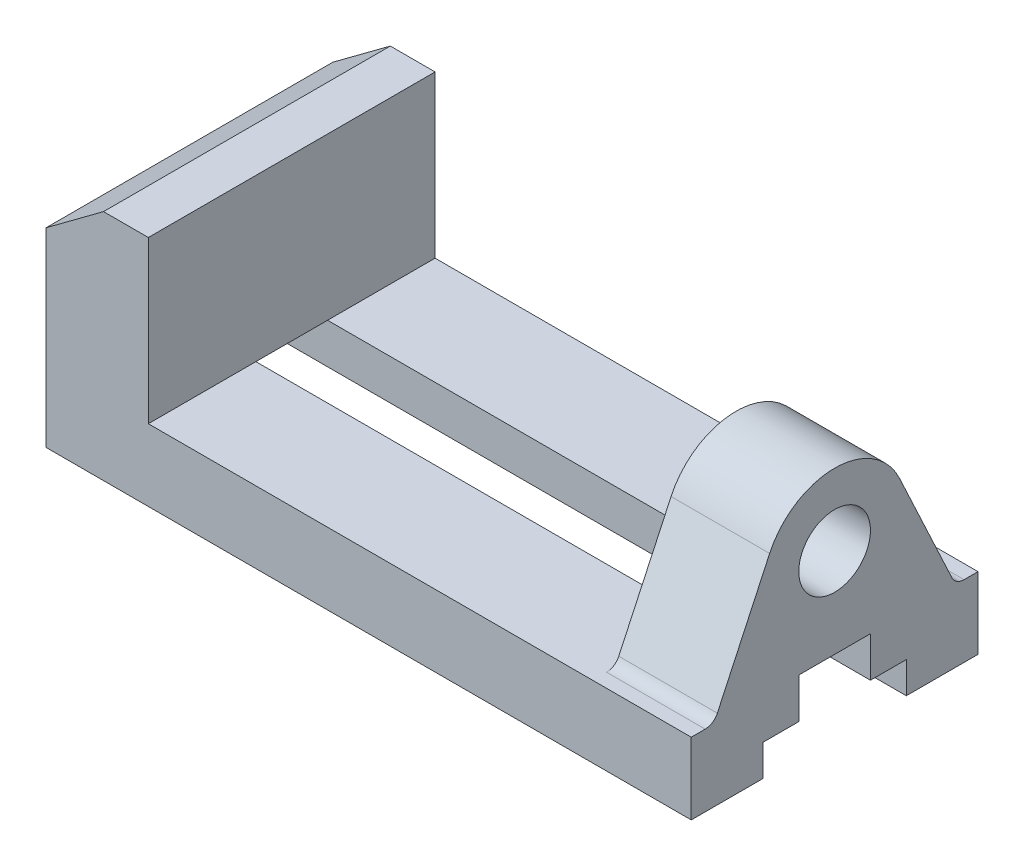
ISO-10303-21;
HEADER;
FILE_DESCRIPTION(('STEP AP214'),'2;1');
FILE_NAME('part.step','',(''),(''),'','','');
FILE_SCHEMA(('AUTOMOTIVE_DESIGN { 1 0 10303 214 1 1 1 1 }'));
ENDSEC;
DATA;
#1=APPLICATION_CONTEXT('core data for automotive mechanical design processes');
#2=APPLICATION_PROTOCOL_DEFINITION('international standard','automotive_design',2000,#1);
#3=PRODUCT_CONTEXT('',#1,'mechanical');
#4=PRODUCT('Part','Part','',(#3));
#5=PRODUCT_RELATED_PRODUCT_CATEGORY('part','',(#4));
#6=PRODUCT_DEFINITION_FORMATION('','',#4);
#7=PRODUCT_DEFINITION_CONTEXT('part definition',#1,'design');
#8=PRODUCT_DEFINITION('design','',#6,#7);
#9=PRODUCT_DEFINITION_SHAPE('','',#8);
#10=(LENGTH_UNIT() NAMED_UNIT(*) SI_UNIT(.MILLI.,.METRE.));
#11=(NAMED_UNIT(*) PLANE_ANGLE_UNIT() SI_UNIT($,.RADIAN.));
#12=(NAMED_UNIT(*) SI_UNIT($,.STERADIAN.) SOLID_ANGLE_UNIT());
#13=UNCERTAINTY_MEASURE_WITH_UNIT(LENGTH_MEASURE(1.E-05),#10,'distance_accuracy_value','');
#14=(GEOMETRIC_REPRESENTATION_CONTEXT(3) GLOBAL_UNCERTAINTY_ASSIGNED_CONTEXT((#13)) GLOBAL_UNIT_ASSIGNED_CONTEXT((#10,
#11,#12)) REPRESENTATION_CONTEXT('',''));
#15=CARTESIAN_POINT('',(0.,0.,0.));
#16=DIRECTION('',(0.,0.,1.));
#17=DIRECTION('',(1.,0.,0.));
#18=AXIS2_PLACEMENT_3D('',#15,#16,#17);
#19=CARTESIAN_POINT('',(22.8395146915876,16.,32.));
#20=DIRECTION('',(0.,-1.,0.));
#21=DIRECTION('',(0.,0.,-1.));
#22=AXIS2_PLACEMENT_3D('',#19,#20,#21);
#23=PLANE('',#22);
#24=DIRECTION('',(0.,0.,1.));
#25=VECTOR('',#24,1.);
#26=CARTESIAN_POINT('',(122.,16.,0.));
#27=LINE('',#26,#25);
#28=CARTESIAN_POINT('',(122.,16.,8.));
#29=VERTEX_POINT('',#28);
#30=CARTESIAN_POINT('',(122.,16.,28.8914106489223));
#31=VERTEX_POINT('',#30);
#32=EDGE_CURVE('E361',#29,#31,#27,.T.);
#33=ORIENTED_EDGE('',*,*,#32,.F.);
#34=DIRECTION('',(1.,0.,0.));
#35=VECTOR('',#34,1.);
#36=CARTESIAN_POINT('',(-0.001000000000001,16.,8.));
#37=LINE('',#36,#35);
#38=CARTESIAN_POINT('',(22.8395146915876,16.,8.));
#39=VERTEX_POINT('',#38);
#40=EDGE_CURVE('E67',#39,#29,#37,.T.);
#41=ORIENTED_EDGE('',*,*,#40,.F.);
#42=DIRECTION('',(0.,0.,-1.));
#43=VECTOR('',#42,1.);
#44=CARTESIAN_POINT('',(22.8395146915876,16.,32.));
#45=LINE('',#44,#43);
#46=CARTESIAN_POINT('',(22.8395146915876,16.,32.));
#47=VERTEX_POINT('',#46);
#48=EDGE_CURVE('E242',#47,#39,#45,.T.);
#49=ORIENTED_EDGE('',*,*,#48,.F.);
#50=DIRECTION('',(-1.,0.,0.));
#51=VECTOR('',#50,1.);
#52=CARTESIAN_POINT('',(22.8395146915876,16.,32.));
#53=LINE('',#52,#51);
#54=CARTESIAN_POINT('',(144.,16.,32.));
#55=VERTEX_POINT('',#54);
#56=EDGE_CURVE('E291',#55,#47,#53,.T.);
#57=ORIENTED_EDGE('',*,*,#56,.F.);
#58=DIRECTION('',(0.,0.,-1.));
#59=VECTOR('',#58,1.);
#60=CARTESIAN_POINT('',(144.,16.,32.));
#61=LINE('',#60,#59);
#62=CARTESIAN_POINT('',(144.,16.,28.8914106489223));
#63=VERTEX_POINT('',#62);
#64=EDGE_CURVE('E245',#55,#63,#61,.T.);
#65=ORIENTED_EDGE('',*,*,#64,.T.);
#66=DIRECTION('',(1.,0.,0.));
#67=VECTOR('',#66,1.);
#68=CARTESIAN_POINT('',(122.,16.,28.8914106489223));
#69=LINE('',#68,#67);
#70=EDGE_CURVE('E308',#31,#63,#69,.T.);
#71=ORIENTED_EDGE('',*,*,#70,.F.);
#72=EDGE_LOOP('',(#33,#41,#49,#57,#65,#71));
#73=FACE_BOUND('',#72,.T.);
#74=ADVANCED_FACE('F44',(#73),#23,.F.);
#75=CARTESIAN_POINT('',(144.,0.,32.));
#76=DIRECTION('',(0.,1.,0.));
#77=DIRECTION('',(0.,0.,1.));
#78=AXIS2_PLACEMENT_3D('',#75,#76,#77);
#79=PLANE('',#78);
#80=CARTESIAN_POINT('',(108.,0.,22.));
#81=DIRECTION('',(0.,-1.,0.));
#82=DIRECTION('',(0.,0.,-1.));
#83=AXIS2_PLACEMENT_3D('',#80,#81,#82);
#84=CIRCLE('',#83,3.);
#85=CARTESIAN_POINT('',(108.,0.,19.));
#86=VERTEX_POINT('',#85);
#87=EDGE_CURVE('E419',#86,#86,#84,.T.);
#88=ORIENTED_EDGE('',*,*,#87,.F.);
#89=EDGE_LOOP('',(#88));
#90=FACE_BOUND('',#89,.T.);
#91=CARTESIAN_POINT('',(38.,0.,22.));
#92=DIRECTION('',(0.,-1.,0.));
#93=DIRECTION('',(0.,0.,-1.));
#94=AXIS2_PLACEMENT_3D('',#91,#92,#93);
#95=CIRCLE('',#94,3.);
#96=CARTESIAN_POINT('',(38.,0.,19.));
#97=VERTEX_POINT('',#96);
#98=EDGE_CURVE('E416',#97,#97,#95,.T.);
#99=ORIENTED_EDGE('',*,*,#98,.F.);
#100=EDGE_LOOP('',(#99));
#101=FACE_BOUND('',#100,.T.);
#102=DIRECTION('',(0.,0.,-1.));
#103=VECTOR('',#102,1.);
#104=CARTESIAN_POINT('',(0.,0.,32.));
#105=LINE('',#104,#103);
#106=CARTESIAN_POINT('',(0.,0.,32.));
#107=VERTEX_POINT('',#106);
#108=CARTESIAN_POINT('',(0.,0.,16.));
#109=VERTEX_POINT('',#108);
#110=EDGE_CURVE('E224',#107,#109,#105,.T.);
#111=ORIENTED_EDGE('',*,*,#110,.T.);
#112=DIRECTION('',(1.,0.,0.));
#113=VECTOR('',#112,1.);
#114=CARTESIAN_POINT('',(-0.001000000000001,0.,16.));
#115=LINE('',#114,#113);
#116=CARTESIAN_POINT('',(144.,0.,16.));
#117=VERTEX_POINT('',#116);
#118=EDGE_CURVE('E209',#109,#117,#115,.T.);
#119=ORIENTED_EDGE('',*,*,#118,.T.);
#120=DIRECTION('',(0.,0.,-1.));
#121=VECTOR('',#120,1.);
#122=CARTESIAN_POINT('',(144.,0.,32.));
#123=LINE('',#122,#121);
#124=CARTESIAN_POINT('',(144.,0.,32.));
#125=VERTEX_POINT('',#124);
#126=EDGE_CURVE('E13',#125,#117,#123,.T.);
#127=ORIENTED_EDGE('',*,*,#126,.F.);
#128=DIRECTION('',(1.,0.,0.));
#129=VECTOR('',#128,1.);
#130=CARTESIAN_POINT('',(144.,0.,32.));
#131=LINE('',#130,#129);
#132=EDGE_CURVE('E284',#107,#125,#131,.T.);
#133=ORIENTED_EDGE('',*,*,#132,.F.);
#134=EDGE_LOOP('',(#111,#119,#127,#133));
#135=FACE_BOUND('',#134,.T.);
#136=ADVANCED_FACE('F388',(#90,#101,#135),#79,.F.);
#137=CARTESIAN_POINT('',(22.8395146915876,16.,-8.));
#138=VERTEX_POINT('',#137);
#139=CARTESIAN_POINT('',(22.8395146915876,16.,-32.));
#140=VERTEX_POINT('',#139);
#141=EDGE_CURVE('E241',#138,#140,#45,.T.);
#142=ORIENTED_EDGE('',*,*,#141,.F.);
#143=DIRECTION('',(1.,0.,0.));
#144=VECTOR('',#143,1.);
#145=CARTESIAN_POINT('',(-0.001000000000001,16.,-8.));
#146=LINE('',#145,#144);
#147=CARTESIAN_POINT('',(122.,16.,-8.));
#148=VERTEX_POINT('',#147);
#149=EDGE_CURVE('E474',#138,#148,#146,.T.);
#150=ORIENTED_EDGE('',*,*,#149,.T.);
#151=CARTESIAN_POINT('',(122.,16.,-28.8914106489223));
#152=VERTEX_POINT('',#151);
#153=EDGE_CURVE('E330',#152,#148,#27,.T.);
#154=ORIENTED_EDGE('',*,*,#153,.F.);
#155=DIRECTION('',(1.,0.,0.));
#156=VECTOR('',#155,1.);
#157=CARTESIAN_POINT('',(122.,16.,-28.8914106489223));
#158=LINE('',#157,#156);
#159=CARTESIAN_POINT('',(144.,16.,-28.8914106489223));
#160=VERTEX_POINT('',#159);
#161=EDGE_CURVE('E261',#152,#160,#158,.T.);
#162=ORIENTED_EDGE('',*,*,#161,.T.);
#163=CARTESIAN_POINT('',(144.,16.,-32.));
#164=VERTEX_POINT('',#163);
#165=EDGE_CURVE('E244',#160,#164,#61,.T.);
#166=ORIENTED_EDGE('',*,*,#165,.T.);
#167=DIRECTION('',(-1.,0.,0.));
#168=VECTOR('',#167,1.);
#169=CARTESIAN_POINT('',(22.8395146915876,16.,-32.));
#170=LINE('',#169,#168);
#171=EDGE_CURVE('E258',#164,#140,#170,.T.);
#172=ORIENTED_EDGE('',*,*,#171,.T.);
#173=EDGE_LOOP('',(#142,#150,#154,#162,#166,#172));
#174=FACE_BOUND('',#173,.T.);
#175=ADVANCED_FACE('F256',(#174),#23,.F.);
#176=CARTESIAN_POINT('',(108.,0.,-22.));
#177=DIRECTION('',(0.,-1.,0.));
#178=DIRECTION('',(0.,0.,-1.));
#179=AXIS2_PLACEMENT_3D('',#176,#177,#178);
#180=CIRCLE('',#179,3.);
#181=CARTESIAN_POINT('',(108.,0.,-25.));
#182=VERTEX_POINT('',#181);
#183=EDGE_CURVE('E407',#182,#182,#180,.T.);
#184=ORIENTED_EDGE('',*,*,#183,.F.);
#185=EDGE_LOOP('',(#184));
#186=FACE_BOUND('',#185,.T.);
#187=CARTESIAN_POINT('',(38.,0.,-22.));
#188=DIRECTION('',(0.,-1.,0.));
#189=DIRECTION('',(0.,0.,-1.));
#190=AXIS2_PLACEMENT_3D('',#187,#188,#189);
#191=CIRCLE('',#190,3.);
#192=CARTESIAN_POINT('',(38.,0.,-25.));
#193=VERTEX_POINT('',#192);
#194=EDGE_CURVE('E410',#193,#193,#191,.T.);
#195=ORIENTED_EDGE('',*,*,#194,.F.);
#196=EDGE_LOOP('',(#195));
#197=FACE_BOUND('',#196,.T.);
#198=CARTESIAN_POINT('',(144.,0.,-16.));
#199=VERTEX_POINT('',#198);
#200=CARTESIAN_POINT('',(144.,0.,-32.));
#201=VERTEX_POINT('',#200);
#202=EDGE_CURVE('E52',#199,#201,#123,.T.);
#203=ORIENTED_EDGE('',*,*,#202,.F.);
#204=DIRECTION('',(1.,0.,0.));
#205=VECTOR('',#204,1.);
#206=CARTESIAN_POINT('',(-0.001000000000001,0.,-16.));
#207=LINE('',#206,#205);
#208=CARTESIAN_POINT('',(0.,0.,-16.));
#209=VERTEX_POINT('',#208);
#210=EDGE_CURVE('E203',#209,#199,#207,.T.);
#211=ORIENTED_EDGE('',*,*,#210,.F.);
#212=CARTESIAN_POINT('',(0.,0.,-32.));
#213=VERTEX_POINT('',#212);
#214=EDGE_CURVE('E214',#209,#213,#105,.T.);
#215=ORIENTED_EDGE('',*,*,#214,.T.);
#216=DIRECTION('',(1.,0.,0.));
#217=VECTOR('',#216,1.);
#218=CARTESIAN_POINT('',(144.,0.,-32.));
#219=LINE('',#218,#217);
#220=EDGE_CURVE('E270',#213,#201,#219,.T.);
#221=ORIENTED_EDGE('',*,*,#220,.T.);
#222=EDGE_LOOP('',(#203,#211,#215,#221));
#223=FACE_BOUND('',#222,.T.);
#224=ADVANCED_FACE('F46',(#186,#197,#223),#79,.F.);
#225=CARTESIAN_POINT('',(144.,16.,32.));
#226=DIRECTION('',(-1.,0.,0.));
#227=DIRECTION('',(0.,0.,1.));
#228=AXIS2_PLACEMENT_3D('',#225,#226,#227);
#229=PLANE('',#228);
#230=ORIENTED_EDGE('',*,*,#126,.T.);
#231=DIRECTION('',(0.,-1.,0.));
#232=VECTOR('',#231,1.);
#233=CARTESIAN_POINT('',(144.,0.,16.));
#234=LINE('',#233,#232);
#235=CARTESIAN_POINT('',(144.,7.,16.));
#236=VERTEX_POINT('',#235);
#237=EDGE_CURVE('E216',#236,#117,#234,.T.);
#238=ORIENTED_EDGE('',*,*,#237,.F.);
#239=DIRECTION('',(0.,0.,1.));
#240=VECTOR('',#239,1.);
#241=CARTESIAN_POINT('',(144.,7.,16.));
#242=LINE('',#241,#240);
#243=CARTESIAN_POINT('',(144.,7.,8.));
#244=VERTEX_POINT('',#243);
#245=EDGE_CURVE('E458',#244,#236,#242,.T.);
#246=ORIENTED_EDGE('',*,*,#245,.F.);
#247=DIRECTION('',(0.,-1.,0.));
#248=VECTOR('',#247,1.);
#249=CARTESIAN_POINT('',(144.,7.,8.));
#250=LINE('',#249,#248);
#251=CARTESIAN_POINT('',(144.,16.,8.));
#252=VERTEX_POINT('',#251);
#253=EDGE_CURVE('E455',#252,#244,#250,.T.);
#254=ORIENTED_EDGE('',*,*,#253,.F.);
#255=DIRECTION('',(0.,0.,1.));
#256=VECTOR('',#255,1.);
#257=CARTESIAN_POINT('',(144.,16.,8.));
#258=LINE('',#257,#256);
#259=CARTESIAN_POINT('',(144.,16.,-8.));
#260=VERTEX_POINT('',#259);
#261=EDGE_CURVE('E452',#260,#252,#258,.T.);
#262=ORIENTED_EDGE('',*,*,#261,.F.);
#263=DIRECTION('',(0.,1.,0.));
#264=VECTOR('',#263,1.);
#265=CARTESIAN_POINT('',(144.,16.,-8.));
#266=LINE('',#265,#264);
#267=CARTESIAN_POINT('',(144.,7.,-8.));
#268=VERTEX_POINT('',#267);
#269=EDGE_CURVE('E449',#268,#260,#266,.T.);
#270=ORIENTED_EDGE('',*,*,#269,.F.);
#271=DIRECTION('',(0.,0.,1.));
#272=VECTOR('',#271,1.);
#273=CARTESIAN_POINT('',(144.,7.,-8.));
#274=LINE('',#273,#272);
#275=CARTESIAN_POINT('',(144.,7.,-16.));
#276=VERTEX_POINT('',#275);
#277=EDGE_CURVE('E446',#276,#268,#274,.T.);
#278=ORIENTED_EDGE('',*,*,#277,.F.);
#279=DIRECTION('',(0.,1.,0.));
#280=VECTOR('',#279,1.);
#281=CARTESIAN_POINT('',(144.,7.,-16.));
#282=LINE('',#281,#280);
#283=EDGE_CURVE('E444',#199,#276,#282,.T.);
#284=ORIENTED_EDGE('',*,*,#283,.F.);
#285=ORIENTED_EDGE('',*,*,#202,.T.);
#286=DIRECTION('',(0.,1.,0.));
#287=VECTOR('',#286,1.);
#288=CARTESIAN_POINT('',(144.,16.,-32.));
#289=LINE('',#288,#287);
#290=EDGE_CURVE('E266',#201,#164,#289,.T.);
#291=ORIENTED_EDGE('',*,*,#290,.T.);
#292=ORIENTED_EDGE('',*,*,#165,.F.);
#293=CARTESIAN_POINT('',(144.,19.,-28.8914106489223));
#294=DIRECTION('',(1.,0.,0.));
#295=DIRECTION('',(0.,0.,-1.));
#296=AXIS2_PLACEMENT_3D('',#293,#294,#295);
#297=CIRCLE('',#296,3.);
#298=CARTESIAN_POINT('',(144.,17.7321452147779,-26.1724872878124));
#299=VERTEX_POINT('',#298);
#300=EDGE_CURVE('E344',#160,#299,#297,.F.);
#301=ORIENTED_EDGE('',*,*,#300,.T.);
#302=DIRECTION('',(0.,-0.90630778703665,-0.4226182617407));
#303=VECTOR('',#302,1.);
#304=CARTESIAN_POINT('',(144.,13.1917152134935,-28.289724568728));
#305=LINE('',#304,#303);
#306=CARTESIAN_POINT('',(144.,42.7618921878512,-14.5009245925864));
#307=VERTEX_POINT('',#306);
#308=EDGE_CURVE('E334',#307,#299,#305,.T.);
#309=ORIENTED_EDGE('',*,*,#308,.F.);
#310=CARTESIAN_POINT('',(144.,36.,0.));
#311=DIRECTION('',(1.,0.,0.));
#312=DIRECTION('',(0.,0.,-1.));
#313=AXIS2_PLACEMENT_3D('',#310,#311,#312);
#314=CIRCLE('',#313,16.);
#315=CARTESIAN_POINT('',(144.,42.7618921878512,14.5009245925864));
#316=VERTEX_POINT('',#315);
#317=EDGE_CURVE('E336',#307,#316,#314,.T.);
#318=ORIENTED_EDGE('',*,*,#317,.T.);
#319=DIRECTION('',(0.,-0.90630778703665,0.4226182617407));
#320=VECTOR('',#319,1.);
#321=CARTESIAN_POINT('',(144.,13.1917152134935,28.289724568728));
#322=LINE('',#321,#320);
#323=CARTESIAN_POINT('',(144.,17.7321452147779,26.1724872878124));
#324=VERTEX_POINT('',#323);
#325=EDGE_CURVE('E339',#316,#324,#322,.T.);
#326=ORIENTED_EDGE('',*,*,#325,.T.);
#327=CARTESIAN_POINT('',(144.,19.,28.8914106489223));
#328=DIRECTION('',(1.,0.,0.));
#329=DIRECTION('',(0.,0.,-1.));
#330=AXIS2_PLACEMENT_3D('',#327,#328,#329);
#331=CIRCLE('',#330,3.);
#332=EDGE_CURVE('E342',#63,#324,#331,.T.);
#333=ORIENTED_EDGE('',*,*,#332,.F.);
#334=ORIENTED_EDGE('',*,*,#64,.F.);
#335=DIRECTION('',(0.,1.,0.));
#336=VECTOR('',#335,1.);
#337=CARTESIAN_POINT('',(144.,16.,32.));
#338=LINE('',#337,#336);
#339=EDGE_CURVE('E286',#125,#55,#338,.T.);
#340=ORIENTED_EDGE('',*,*,#339,.F.);
#341=EDGE_LOOP('',(#230,#238,#246,#254,#262,#270,#278,#284,#285,#291,#292,#301,#309,#318,#326,
#333,#334,#340));
#342=FACE_BOUND('',#341,.T.);
#343=CARTESIAN_POINT('',(144.,36.,0.));
#344=DIRECTION('',(1.,0.,0.));
#345=DIRECTION('',(0.,0.,-1.));
#346=AXIS2_PLACEMENT_3D('',#343,#344,#345);
#347=CIRCLE('',#346,8.);
#348=CARTESIAN_POINT('',(144.,36.,-8.));
#349=VERTEX_POINT('',#348);
#350=EDGE_CURVE('E311',#349,#349,#347,.T.);
#351=ORIENTED_EDGE('',*,*,#350,.F.);
#352=EDGE_LOOP('',(#351));
#353=FACE_BOUND('',#352,.T.);
#354=ADVANCED_FACE('F267',(#342,#353),#229,.F.);
#355=CARTESIAN_POINT('',(22.8395146915876,52.,32.));
#356=DIRECTION('',(-1.,0.,0.));
#357=DIRECTION('',(0.,-1.,0.));
#358=AXIS2_PLACEMENT_3D('',#355,#356,#357);
#359=PLANE('',#358);
#360=DIRECTION('',(0.,1.,0.));
#361=VECTOR('',#360,1.);
#362=CARTESIAN_POINT('',(22.8395146915876,52.,-32.));
#363=LINE('',#362,#361);
#364=CARTESIAN_POINT('',(22.8395146915876,52.,-32.));
#365=VERTEX_POINT('',#364);
#366=EDGE_CURVE('E274',#140,#365,#363,.T.);
#367=ORIENTED_EDGE('',*,*,#366,.T.);
#368=DIRECTION('',(0.,0.,-1.));
#369=VECTOR('',#368,1.);
#370=CARTESIAN_POINT('',(22.8395146915876,52.,32.));
#371=LINE('',#370,#369);
#372=CARTESIAN_POINT('',(22.8395146915876,52.,32.));
#373=VERTEX_POINT('',#372);
#374=EDGE_CURVE('E238',#373,#365,#371,.T.);
#375=ORIENTED_EDGE('',*,*,#374,.F.);
#376=DIRECTION('',(0.,1.,0.));
#377=VECTOR('',#376,1.);
#378=CARTESIAN_POINT('',(22.8395146915876,52.,32.));
#379=LINE('',#378,#377);
#380=EDGE_CURVE('E298',#47,#373,#379,.T.);
#381=ORIENTED_EDGE('',*,*,#380,.F.);
#382=ORIENTED_EDGE('',*,*,#48,.T.);
#383=DIRECTION('',(0.,0.,-1.));
#384=VECTOR('',#383,1.);
#385=CARTESIAN_POINT('',(22.8395146915876,16.,32.));
#386=LINE('',#385,#384);
#387=EDGE_CURVE('E208',#39,#138,#386,.T.);
#388=ORIENTED_EDGE('',*,*,#387,.T.);
#389=ORIENTED_EDGE('',*,*,#141,.T.);
#390=EDGE_LOOP('',(#367,#375,#381,#382,#388,#389));
#391=FACE_BOUND('',#390,.T.);
#392=ADVANCED_FACE('F403',(#391),#359,.F.);
#393=CARTESIAN_POINT('',(12.8395146915876,52.,32.));
#394=DIRECTION('',(0.,-1.,0.));
#395=DIRECTION('',(0.,0.,-1.));
#396=AXIS2_PLACEMENT_3D('',#393,#394,#395);
#397=PLANE('',#396);
#398=DIRECTION('',(-1.,0.,0.));
#399=VECTOR('',#398,1.);
#400=CARTESIAN_POINT('',(12.8395146915876,52.,-32.));
#401=LINE('',#400,#399);
#402=CARTESIAN_POINT('',(12.8395146915876,52.,-32.));
#403=VERTEX_POINT('',#402);
#404=EDGE_CURVE('E276',#365,#403,#401,.T.);
#405=ORIENTED_EDGE('',*,*,#404,.T.);
#406=DIRECTION('',(0.,0.,-1.));
#407=VECTOR('',#406,1.);
#408=CARTESIAN_POINT('',(12.8395146915876,52.,32.));
#409=LINE('',#408,#407);
#410=CARTESIAN_POINT('',(12.8395146915876,52.,32.));
#411=VERTEX_POINT('',#410);
#412=EDGE_CURVE('E235',#411,#403,#409,.T.);
#413=ORIENTED_EDGE('',*,*,#412,.F.);
#414=DIRECTION('',(-1.,0.,0.));
#415=VECTOR('',#414,1.);
#416=CARTESIAN_POINT('',(12.8395146915876,52.,32.));
#417=LINE('',#416,#415);
#418=EDGE_CURVE('E300',#373,#411,#417,.T.);
#419=ORIENTED_EDGE('',*,*,#418,.F.);
#420=ORIENTED_EDGE('',*,*,#374,.T.);
#421=EDGE_LOOP('',(#405,#413,#419,#420));
#422=FACE_BOUND('',#421,.T.);
#423=ADVANCED_FACE('F511',(#422),#397,.F.);
#424=CARTESIAN_POINT('',(0.,42.4529134033201,32.));
#425=DIRECTION('',(0.596692912292495,-0.802469668224227,0.));
#426=DIRECTION('',(0.802469668224227,0.596692912292495,0.));
#427=AXIS2_PLACEMENT_3D('',#424,#425,#426);
#428=PLANE('',#427);
#429=DIRECTION('',(-0.802469668224227,-0.596692912292495,0.));
#430=VECTOR('',#429,1.);
#431=CARTESIAN_POINT('',(0.,42.4529134033201,-32.));
#432=LINE('',#431,#430);
#433=CARTESIAN_POINT('',(0.,42.4529134033201,-32.));
#434=VERTEX_POINT('',#433);
#435=EDGE_CURVE('E280',#403,#434,#432,.T.);
#436=ORIENTED_EDGE('',*,*,#435,.T.);
#437=DIRECTION('',(0.,0.,-1.));
#438=VECTOR('',#437,1.);
#439=CARTESIAN_POINT('',(0.,42.4529134033201,32.));
#440=LINE('',#439,#438);
#441=CARTESIAN_POINT('',(0.,42.4529134033201,32.));
#442=VERTEX_POINT('',#441);
#443=EDGE_CURVE('E228',#442,#434,#440,.T.);
#444=ORIENTED_EDGE('',*,*,#443,.F.);
#445=DIRECTION('',(-0.802469668224227,-0.596692912292495,0.));
#446=VECTOR('',#445,1.);
#447=CARTESIAN_POINT('',(0.,42.4529134033201,32.));
#448=LINE('',#447,#446);
#449=EDGE_CURVE('E229',#411,#442,#448,.T.);
#450=ORIENTED_EDGE('',*,*,#449,.F.);
#451=ORIENTED_EDGE('',*,*,#412,.T.);
#452=EDGE_LOOP('',(#436,#444,#450,#451));
#453=FACE_BOUND('',#452,.T.);
#454=ADVANCED_FACE('F513',(#453),#428,.F.);
#455=CARTESIAN_POINT('',(0.,0.,32.));
#456=DIRECTION('',(1.,0.,0.));
#457=DIRECTION('',(0.,0.,-1.));
#458=AXIS2_PLACEMENT_3D('',#455,#456,#457);
#459=PLANE('',#458);
#460=DIRECTION('',(0.,0.,-1.));
#461=VECTOR('',#460,1.);
#462=CARTESIAN_POINT('',(0.,7.,16.));
#463=LINE('',#462,#461);
#464=CARTESIAN_POINT('',(0.,7.,16.));
#465=VERTEX_POINT('',#464);
#466=CARTESIAN_POINT('',(0.,7.,8.));
#467=VERTEX_POINT('',#466);
#468=EDGE_CURVE('E438',#465,#467,#463,.T.);
#469=ORIENTED_EDGE('',*,*,#468,.F.);
#470=DIRECTION('',(0.,1.,0.));
#471=VECTOR('',#470,1.);
#472=CARTESIAN_POINT('',(0.,0.,16.));
#473=LINE('',#472,#471);
#474=EDGE_CURVE('E441',#109,#465,#473,.T.);
#475=ORIENTED_EDGE('',*,*,#474,.F.);
#476=ORIENTED_EDGE('',*,*,#110,.F.);
#477=DIRECTION('',(0.,-1.,0.));
#478=VECTOR('',#477,1.);
#479=CARTESIAN_POINT('',(0.,0.,32.));
#480=LINE('',#479,#478);
#481=EDGE_CURVE('E225',#442,#107,#480,.T.);
#482=ORIENTED_EDGE('',*,*,#481,.F.);
#483=ORIENTED_EDGE('',*,*,#443,.T.);
#484=DIRECTION('',(0.,-1.,0.));
#485=VECTOR('',#484,1.);
#486=CARTESIAN_POINT('',(0.,0.,-32.));
#487=LINE('',#486,#485);
#488=EDGE_CURVE('E222',#434,#213,#487,.T.);
#489=ORIENTED_EDGE('',*,*,#488,.T.);
#490=ORIENTED_EDGE('',*,*,#214,.F.);
#491=DIRECTION('',(0.,-1.,0.));
#492=VECTOR('',#491,1.);
#493=CARTESIAN_POINT('',(0.,7.,-16.));
#494=LINE('',#493,#492);
#495=CARTESIAN_POINT('',(0.,7.,-16.));
#496=VERTEX_POINT('',#495);
#497=EDGE_CURVE('E199',#496,#209,#494,.T.);
#498=ORIENTED_EDGE('',*,*,#497,.F.);
#499=DIRECTION('',(0.,0.,-1.));
#500=VECTOR('',#499,1.);
#501=CARTESIAN_POINT('',(0.,7.,-8.));
#502=LINE('',#501,#500);
#503=CARTESIAN_POINT('',(0.,7.,-8.));
#504=VERTEX_POINT('',#503);
#505=EDGE_CURVE('E59',#504,#496,#502,.T.);
#506=ORIENTED_EDGE('',*,*,#505,.F.);
#507=DIRECTION('',(0.,-1.,0.));
#508=VECTOR('',#507,1.);
#509=CARTESIAN_POINT('',(0.,16.,-8.));
#510=LINE('',#509,#508);
#511=CARTESIAN_POINT('',(0.,16.,-8.));
#512=VERTEX_POINT('',#511);
#513=EDGE_CURVE('E429',#512,#504,#510,.T.);
#514=ORIENTED_EDGE('',*,*,#513,.F.);
#515=DIRECTION('',(0.,0.,-1.));
#516=VECTOR('',#515,1.);
#517=CARTESIAN_POINT('',(0.,16.,8.));
#518=LINE('',#517,#516);
#519=CARTESIAN_POINT('',(0.,16.,8.));
#520=VERTEX_POINT('',#519);
#521=EDGE_CURVE('E432',#520,#512,#518,.T.);
#522=ORIENTED_EDGE('',*,*,#521,.F.);
#523=DIRECTION('',(0.,1.,0.));
#524=VECTOR('',#523,1.);
#525=CARTESIAN_POINT('',(0.,7.,8.));
#526=LINE('',#525,#524);
#527=EDGE_CURVE('E435',#467,#520,#526,.T.);
#528=ORIENTED_EDGE('',*,*,#527,.F.);
#529=EDGE_LOOP('',(#469,#475,#476,#482,#483,#489,#490,#498,#506,#514,#522,#528));
#530=FACE_BOUND('',#529,.T.);
#531=ADVANCED_FACE('F219',(#530),#459,.F.);
#532=CARTESIAN_POINT('',(0.,0.,32.));
#533=DIRECTION('',(0.,0.,-1.));
#534=DIRECTION('',(-1.,0.,0.));
#535=AXIS2_PLACEMENT_3D('',#532,#533,#534);
#536=PLANE('',#535);
#537=ORIENTED_EDGE('',*,*,#132,.T.);
#538=ORIENTED_EDGE('',*,*,#339,.T.);
#539=ORIENTED_EDGE('',*,*,#56,.T.);
#540=ORIENTED_EDGE('',*,*,#380,.T.);
#541=ORIENTED_EDGE('',*,*,#418,.T.);
#542=ORIENTED_EDGE('',*,*,#449,.T.);
#543=ORIENTED_EDGE('',*,*,#481,.T.);
#544=EDGE_LOOP('',(#537,#538,#539,#540,#541,#542,#543));
#545=FACE_BOUND('',#544,.T.);
#546=ADVANCED_FACE('F503',(#545),#536,.F.);
#547=CARTESIAN_POINT('',(0.,0.,-32.));
#548=DIRECTION('',(0.,0.,-1.));
#549=DIRECTION('',(-1.,0.,0.));
#550=AXIS2_PLACEMENT_3D('',#547,#548,#549);
#551=PLANE('',#550);
#552=ORIENTED_EDGE('',*,*,#220,.F.);
#553=ORIENTED_EDGE('',*,*,#488,.F.);
#554=ORIENTED_EDGE('',*,*,#435,.F.);
#555=ORIENTED_EDGE('',*,*,#404,.F.);
#556=ORIENTED_EDGE('',*,*,#366,.F.);
#557=ORIENTED_EDGE('',*,*,#171,.F.);
#558=ORIENTED_EDGE('',*,*,#290,.F.);
#559=EDGE_LOOP('',(#552,#553,#554,#555,#556,#557,#558));
#560=FACE_BOUND('',#559,.T.);
#561=ADVANCED_FACE('F272',(#560),#551,.T.);
#562=CARTESIAN_POINT('',(122.,13.1917152134935,-28.289724568728));
#563=DIRECTION('',(0.,-0.4226182617407,0.90630778703665));
#564=DIRECTION('',(0.,-0.90630778703665,-0.4226182617407));
#565=AXIS2_PLACEMENT_3D('',#562,#563,#564);
#566=PLANE('',#565);
#567=ORIENTED_EDGE('',*,*,#308,.T.);
#568=DIRECTION('',(1.,0.,0.));
#569=VECTOR('',#568,1.);
#570=CARTESIAN_POINT('',(122.,17.7321452147779,-26.1724872878124));
#571=LINE('',#570,#569);
#572=CARTESIAN_POINT('',(122.,17.7321452147779,-26.1724872878124));
#573=VERTEX_POINT('',#572);
#574=EDGE_CURVE('E302',#573,#299,#571,.T.);
#575=ORIENTED_EDGE('',*,*,#574,.F.);
#576=DIRECTION('',(0.,-0.90630778703665,-0.4226182617407));
#577=VECTOR('',#576,1.);
#578=CARTESIAN_POINT('',(122.,13.1917152134935,-28.289724568728));
#579=LINE('',#578,#577);
#580=CARTESIAN_POINT('',(122.,42.7618921878512,-14.5009245925864));
#581=VERTEX_POINT('',#580);
#582=EDGE_CURVE('E346',#581,#573,#579,.T.);
#583=ORIENTED_EDGE('',*,*,#582,.F.);
#584=DIRECTION('',(1.,0.,0.));
#585=VECTOR('',#584,1.);
#586=CARTESIAN_POINT('',(122.,42.7618921878512,-14.5009245925864));
#587=LINE('',#586,#585);
#588=EDGE_CURVE('E294',#581,#307,#587,.T.);
#589=ORIENTED_EDGE('',*,*,#588,.T.);
#590=EDGE_LOOP('',(#567,#575,#583,#589));
#591=FACE_BOUND('',#590,.T.);
#592=ADVANCED_FACE('F376',(#591),#566,.F.);
#593=CARTESIAN_POINT('',(122.,19.,-28.8914106489223));
#594=DIRECTION('',(1.,0.,0.));
#595=DIRECTION('',(0.,0.,-1.));
#596=AXIS2_PLACEMENT_3D('',#593,#594,#595);
#597=CYLINDRICAL_SURFACE('',#596,3.);
#598=ORIENTED_EDGE('',*,*,#300,.F.);
#599=ORIENTED_EDGE('',*,*,#161,.F.);
#600=CARTESIAN_POINT('',(122.,19.,-28.8914106489223));
#601=DIRECTION('',(1.,0.,0.));
#602=DIRECTION('',(0.,0.,-1.));
#603=AXIS2_PLACEMENT_3D('',#600,#601,#602);
#604=CIRCLE('',#603,3.);
#605=EDGE_CURVE('E326',#152,#573,#604,.F.);
#606=ORIENTED_EDGE('',*,*,#605,.T.);
#607=ORIENTED_EDGE('',*,*,#574,.T.);
#608=EDGE_LOOP('',(#598,#599,#606,#607));
#609=FACE_BOUND('',#608,.T.);
#610=ADVANCED_FACE('F377',(#609),#597,.F.);
#611=CARTESIAN_POINT('',(122.,19.,28.8914106489223));
#612=DIRECTION('',(1.,0.,0.));
#613=DIRECTION('',(0.,0.,-1.));
#614=AXIS2_PLACEMENT_3D('',#611,#612,#613);
#615=CYLINDRICAL_SURFACE('',#614,3.);
#616=ORIENTED_EDGE('',*,*,#332,.T.);
#617=DIRECTION('',(1.,0.,0.));
#618=VECTOR('',#617,1.);
#619=CARTESIAN_POINT('',(122.,17.7321452147779,26.1724872878124));
#620=LINE('',#619,#618);
#621=CARTESIAN_POINT('',(122.,17.7321452147779,26.1724872878124));
#622=VERTEX_POINT('',#621);
#623=EDGE_CURVE('E315',#622,#324,#620,.T.);
#624=ORIENTED_EDGE('',*,*,#623,.F.);
#625=CARTESIAN_POINT('',(122.,19.,28.8914106489223));
#626=DIRECTION('',(1.,0.,0.));
#627=DIRECTION('',(0.,0.,-1.));
#628=AXIS2_PLACEMENT_3D('',#625,#626,#627);
#629=CIRCLE('',#628,3.);
#630=EDGE_CURVE('E360',#31,#622,#629,.T.);
#631=ORIENTED_EDGE('',*,*,#630,.F.);
#632=ORIENTED_EDGE('',*,*,#70,.T.);
#633=EDGE_LOOP('',(#616,#624,#631,#632));
#634=FACE_BOUND('',#633,.T.);
#635=ADVANCED_FACE('F372',(#634),#615,.F.);
#636=CARTESIAN_POINT('',(122.,13.1917152134935,28.289724568728));
#637=DIRECTION('',(0.,0.4226182617407,0.90630778703665));
#638=DIRECTION('',(0.,-0.90630778703665,0.4226182617407));
#639=AXIS2_PLACEMENT_3D('',#636,#637,#638);
#640=PLANE('',#639);
#641=ORIENTED_EDGE('',*,*,#325,.F.);
#642=DIRECTION('',(1.,0.,0.));
#643=VECTOR('',#642,1.);
#644=CARTESIAN_POINT('',(122.,42.7618921878512,14.5009245925864));
#645=LINE('',#644,#643);
#646=CARTESIAN_POINT('',(122.,42.7618921878512,14.5009245925864));
#647=VERTEX_POINT('',#646);
#648=EDGE_CURVE('E316',#647,#316,#645,.T.);
#649=ORIENTED_EDGE('',*,*,#648,.F.);
#650=DIRECTION('',(0.,-0.90630778703665,0.4226182617407));
#651=VECTOR('',#650,1.);
#652=CARTESIAN_POINT('',(122.,13.1917152134935,28.289724568728));
#653=LINE('',#652,#651);
#654=EDGE_CURVE('E354',#647,#622,#653,.T.);
#655=ORIENTED_EDGE('',*,*,#654,.T.);
#656=ORIENTED_EDGE('',*,*,#623,.T.);
#657=EDGE_LOOP('',(#641,#649,#655,#656));
#658=FACE_BOUND('',#657,.T.);
#659=ADVANCED_FACE('F374',(#658),#640,.T.);
#660=CARTESIAN_POINT('',(122.,36.,0.));
#661=DIRECTION('',(1.,0.,0.));
#662=DIRECTION('',(0.,0.,-1.));
#663=AXIS2_PLACEMENT_3D('',#660,#661,#662);
#664=CYLINDRICAL_SURFACE('',#663,16.);
#665=ORIENTED_EDGE('',*,*,#317,.F.);
#666=ORIENTED_EDGE('',*,*,#588,.F.);
#667=CARTESIAN_POINT('',(122.,36.,0.));
#668=DIRECTION('',(1.,0.,0.));
#669=DIRECTION('',(0.,0.,-1.));
#670=AXIS2_PLACEMENT_3D('',#667,#668,#669);
#671=CIRCLE('',#670,16.);
#672=EDGE_CURVE('E349',#581,#647,#671,.T.);
#673=ORIENTED_EDGE('',*,*,#672,.T.);
#674=ORIENTED_EDGE('',*,*,#648,.T.);
#675=EDGE_LOOP('',(#665,#666,#673,#674));
#676=FACE_BOUND('',#675,.T.);
#677=ADVANCED_FACE('F375',(#676),#664,.T.);
#678=CARTESIAN_POINT('',(122.,36.,0.));
#679=DIRECTION('',(1.,0.,0.));
#680=DIRECTION('',(0.,0.,-1.));
#681=AXIS2_PLACEMENT_3D('',#678,#679,#680);
#682=CYLINDRICAL_SURFACE('',#681,8.);
#683=CARTESIAN_POINT('',(122.,36.,0.));
#684=DIRECTION('',(1.,0.,0.));
#685=DIRECTION('',(0.,0.,-1.));
#686=AXIS2_PLACEMENT_3D('',#683,#684,#685);
#687=CIRCLE('',#686,8.);
#688=CARTESIAN_POINT('',(122.,36.,-8.));
#689=VERTEX_POINT('',#688);
#690=EDGE_CURVE('E321',#689,#689,#687,.T.);
#691=ORIENTED_EDGE('',*,*,#690,.F.);
#692=EDGE_LOOP('',(#691));
#693=FACE_BOUND('',#692,.T.);
#694=ORIENTED_EDGE('',*,*,#350,.T.);
#695=EDGE_LOOP('',(#694));
#696=FACE_BOUND('',#695,.T.);
#697=ADVANCED_FACE('F588',(#693,#696),#682,.F.);
#698=CARTESIAN_POINT('',(122.,0.,0.));
#699=DIRECTION('',(1.,0.,0.));
#700=DIRECTION('',(0.,0.,-1.));
#701=AXIS2_PLACEMENT_3D('',#698,#699,#700);
#702=PLANE('',#701);
#703=ORIENTED_EDGE('',*,*,#582,.T.);
#704=ORIENTED_EDGE('',*,*,#605,.F.);
#705=ORIENTED_EDGE('',*,*,#153,.T.);
#706=EDGE_CURVE('E363',#148,#29,#27,.T.);
#707=ORIENTED_EDGE('',*,*,#706,.T.);
#708=ORIENTED_EDGE('',*,*,#32,.T.);
#709=ORIENTED_EDGE('',*,*,#630,.T.);
#710=ORIENTED_EDGE('',*,*,#654,.F.);
#711=ORIENTED_EDGE('',*,*,#672,.F.);
#712=EDGE_LOOP('',(#703,#704,#705,#707,#708,#709,#710,#711));
#713=FACE_BOUND('',#712,.T.);
#714=ORIENTED_EDGE('',*,*,#690,.T.);
#715=EDGE_LOOP('',(#714));
#716=FACE_BOUND('',#715,.T.);
#717=ADVANCED_FACE('F366',(#713,#716),#702,.F.);
#718=CARTESIAN_POINT('',(-0.001000000000001,16.,8.));
#719=DIRECTION('',(0.,1.,0.));
#720=DIRECTION('',(0.,0.,1.));
#721=AXIS2_PLACEMENT_3D('',#718,#719,#720);
#722=PLANE('',#721);
#723=EDGE_CURVE('E468',#520,#39,#37,.T.);
#724=ORIENTED_EDGE('',*,*,#723,.F.);
#725=ORIENTED_EDGE('',*,*,#521,.T.);
#726=EDGE_CURVE('E471',#512,#138,#146,.T.);
#727=ORIENTED_EDGE('',*,*,#726,.T.);
#728=ORIENTED_EDGE('',*,*,#387,.F.);
#729=EDGE_LOOP('',(#724,#725,#727,#728));
#730=FACE_BOUND('',#729,.T.);
#731=ADVANCED_FACE('F491',(#730),#722,.F.);
#732=EDGE_CURVE('E475',#148,#260,#146,.T.);
#733=ORIENTED_EDGE('',*,*,#732,.T.);
#734=ORIENTED_EDGE('',*,*,#261,.T.);
#735=EDGE_CURVE('E470',#29,#252,#37,.T.);
#736=ORIENTED_EDGE('',*,*,#735,.F.);
#737=ORIENTED_EDGE('',*,*,#706,.F.);
#738=EDGE_LOOP('',(#733,#734,#736,#737));
#739=FACE_BOUND('',#738,.T.);
#740=ADVANCED_FACE('F702',(#739),#722,.F.);
#741=CARTESIAN_POINT('',(-0.001000000000001,0.,16.));
#742=DIRECTION('',(0.,0.,1.));
#743=DIRECTION('',(1.,0.,0.));
#744=AXIS2_PLACEMENT_3D('',#741,#742,#743);
#745=PLANE('',#744);
#746=ORIENTED_EDGE('',*,*,#474,.T.);
#747=DIRECTION('',(1.,0.,0.));
#748=VECTOR('',#747,1.);
#749=CARTESIAN_POINT('',(-0.001000000000001,7.,16.));
#750=LINE('',#749,#748);
#751=EDGE_CURVE('E464',#465,#236,#750,.T.);
#752=ORIENTED_EDGE('',*,*,#751,.T.);
#753=ORIENTED_EDGE('',*,*,#237,.T.);
#754=ORIENTED_EDGE('',*,*,#118,.F.);
#755=EDGE_LOOP('',(#746,#752,#753,#754));
#756=FACE_BOUND('',#755,.T.);
#757=ADVANCED_FACE('F699',(#756),#745,.F.);
#758=CARTESIAN_POINT('',(-0.001000000000001,7.,16.));
#759=DIRECTION('',(0.,1.,0.));
#760=DIRECTION('',(0.,0.,1.));
#761=AXIS2_PLACEMENT_3D('',#758,#759,#760);
#762=PLANE('',#761);
#763=ORIENTED_EDGE('',*,*,#468,.T.);
#764=DIRECTION('',(1.,0.,0.));
#765=VECTOR('',#764,1.);
#766=CARTESIAN_POINT('',(-0.001000000000001,7.,8.));
#767=LINE('',#766,#765);
#768=EDGE_CURVE('E466',#467,#244,#767,.T.);
#769=ORIENTED_EDGE('',*,*,#768,.T.);
#770=ORIENTED_EDGE('',*,*,#245,.T.);
#771=ORIENTED_EDGE('',*,*,#751,.F.);
#772=EDGE_LOOP('',(#763,#769,#770,#771));
#773=FACE_BOUND('',#772,.T.);
#774=ADVANCED_FACE('F496',(#773),#762,.F.);
#775=CARTESIAN_POINT('',(-0.001000000000001,7.,8.));
#776=DIRECTION('',(0.,0.,1.));
#777=DIRECTION('',(1.,0.,0.));
#778=AXIS2_PLACEMENT_3D('',#775,#776,#777);
#779=PLANE('',#778);
#780=ORIENTED_EDGE('',*,*,#527,.T.);
#781=ORIENTED_EDGE('',*,*,#723,.T.);
#782=ORIENTED_EDGE('',*,*,#40,.T.);
#783=ORIENTED_EDGE('',*,*,#735,.T.);
#784=ORIENTED_EDGE('',*,*,#253,.T.);
#785=ORIENTED_EDGE('',*,*,#768,.F.);
#786=EDGE_LOOP('',(#780,#781,#782,#783,#784,#785));
#787=FACE_BOUND('',#786,.T.);
#788=ADVANCED_FACE('F493',(#787),#779,.F.);
#789=CARTESIAN_POINT('',(-0.001000000000001,16.,-8.));
#790=DIRECTION('',(0.,0.,-1.));
#791=DIRECTION('',(-1.,0.,0.));
#792=AXIS2_PLACEMENT_3D('',#789,#790,#791);
#793=PLANE('',#792);
#794=ORIENTED_EDGE('',*,*,#513,.T.);
#795=DIRECTION('',(1.,0.,0.));
#796=VECTOR('',#795,1.);
#797=CARTESIAN_POINT('',(-0.001000000000001,7.,-8.));
#798=LINE('',#797,#796);
#799=EDGE_CURVE('E476',#504,#268,#798,.T.);
#800=ORIENTED_EDGE('',*,*,#799,.T.);
#801=ORIENTED_EDGE('',*,*,#269,.T.);
#802=ORIENTED_EDGE('',*,*,#732,.F.);
#803=ORIENTED_EDGE('',*,*,#149,.F.);
#804=ORIENTED_EDGE('',*,*,#726,.F.);
#805=EDGE_LOOP('',(#794,#800,#801,#802,#803,#804));
#806=FACE_BOUND('',#805,.T.);
#807=ADVANCED_FACE('F485',(#806),#793,.F.);
#808=CARTESIAN_POINT('',(-0.001000000000001,7.,-8.));
#809=DIRECTION('',(0.,1.,0.));
#810=DIRECTION('',(0.,0.,1.));
#811=AXIS2_PLACEMENT_3D('',#808,#809,#810);
#812=PLANE('',#811);
#813=ORIENTED_EDGE('',*,*,#505,.T.);
#814=DIRECTION('',(1.,0.,0.));
#815=VECTOR('',#814,1.);
#816=CARTESIAN_POINT('',(-0.001000000000001,7.,-16.));
#817=LINE('',#816,#815);
#818=EDGE_CURVE('E205',#496,#276,#817,.T.);
#819=ORIENTED_EDGE('',*,*,#818,.T.);
#820=ORIENTED_EDGE('',*,*,#277,.T.);
#821=ORIENTED_EDGE('',*,*,#799,.F.);
#822=EDGE_LOOP('',(#813,#819,#820,#821));
#823=FACE_BOUND('',#822,.T.);
#824=ADVANCED_FACE('F478',(#823),#812,.F.);
#825=CARTESIAN_POINT('',(-0.001000000000001,7.,-16.));
#826=DIRECTION('',(0.,0.,-1.));
#827=DIRECTION('',(-1.,0.,0.));
#828=AXIS2_PLACEMENT_3D('',#825,#826,#827);
#829=PLANE('',#828);
#830=ORIENTED_EDGE('',*,*,#497,.T.);
#831=ORIENTED_EDGE('',*,*,#210,.T.);
#832=ORIENTED_EDGE('',*,*,#283,.T.);
#833=ORIENTED_EDGE('',*,*,#818,.F.);
#834=EDGE_LOOP('',(#830,#831,#832,#833));
#835=FACE_BOUND('',#834,.T.);
#836=ADVANCED_FACE('F201',(#835),#829,.F.);
#837=CARTESIAN_POINT('',(38.,10.,22.));
#838=DIRECTION('',(0.,-1.,0.));
#839=DIRECTION('',(0.,0.,-1.));
#840=AXIS2_PLACEMENT_3D('',#837,#838,#839);
#841=CYLINDRICAL_SURFACE('',#840,3.);
#842=CARTESIAN_POINT('',(38.,10.,22.));
#843=DIRECTION('',(0.,-1.,0.));
#844=DIRECTION('',(0.,0.,-1.));
#845=AXIS2_PLACEMENT_3D('',#842,#843,#844);
#846=CIRCLE('',#845,3.);
#847=CARTESIAN_POINT('',(38.,10.,19.));
#848=VERTEX_POINT('',#847);
#849=EDGE_CURVE('E423',#848,#848,#846,.T.);
#850=ORIENTED_EDGE('',*,*,#849,.F.);
#851=EDGE_LOOP('',(#850));
#852=FACE_BOUND('',#851,.T.);
#853=ORIENTED_EDGE('',*,*,#98,.T.);
#854=EDGE_LOOP('',(#853));
#855=FACE_BOUND('',#854,.T.);
#856=ADVANCED_FACE('F694',(#852,#855),#841,.F.);
#857=CARTESIAN_POINT('',(38.,10.,22.));
#858=DIRECTION('',(0.,-1.,0.));
#859=DIRECTION('',(0.,0.,-1.));
#860=AXIS2_PLACEMENT_3D('',#857,#858,#859);
#861=PLANE('',#860);
#862=ORIENTED_EDGE('',*,*,#849,.T.);
#863=EDGE_LOOP('',(#862));
#864=FACE_BOUND('',#863,.T.);
#865=ADVANCED_FACE('F636',(#864),#861,.T.);
#866=CARTESIAN_POINT('',(38.,10.,-22.));
#867=DIRECTION('',(0.,-1.,0.));
#868=DIRECTION('',(0.,0.,-1.));
#869=AXIS2_PLACEMENT_3D('',#866,#867,#868);
#870=CYLINDRICAL_SURFACE('',#869,3.);
#871=CARTESIAN_POINT('',(38.,10.,-22.));
#872=DIRECTION('',(0.,-1.,0.));
#873=DIRECTION('',(0.,0.,-1.));
#874=AXIS2_PLACEMENT_3D('',#871,#872,#873);
#875=CIRCLE('',#874,3.);
#876=CARTESIAN_POINT('',(38.,10.,-25.));
#877=VERTEX_POINT('',#876);
#878=EDGE_CURVE('E412',#877,#877,#875,.T.);
#879=ORIENTED_EDGE('',*,*,#878,.F.);
#880=EDGE_LOOP('',(#879));
#881=FACE_BOUND('',#880,.T.);
#882=ORIENTED_EDGE('',*,*,#194,.T.);
#883=EDGE_LOOP('',(#882));
#884=FACE_BOUND('',#883,.T.);
#885=ADVANCED_FACE('F630',(#881,#884),#870,.F.);
#886=CARTESIAN_POINT('',(38.,10.,-22.));
#887=DIRECTION('',(0.,-1.,0.));
#888=DIRECTION('',(0.,0.,-1.));
#889=AXIS2_PLACEMENT_3D('',#886,#887,#888);
#890=PLANE('',#889);
#891=ORIENTED_EDGE('',*,*,#878,.T.);
#892=EDGE_LOOP('',(#891));
#893=FACE_BOUND('',#892,.T.);
#894=ADVANCED_FACE('F635',(#893),#890,.T.);
#895=CARTESIAN_POINT('',(108.,10.,-22.));
#896=DIRECTION('',(0.,-1.,0.));
#897=DIRECTION('',(0.,0.,-1.));
#898=AXIS2_PLACEMENT_3D('',#895,#896,#897);
#899=CYLINDRICAL_SURFACE('',#898,3.);
#900=CARTESIAN_POINT('',(108.,10.,-22.));
#901=DIRECTION('',(0.,-1.,0.));
#902=DIRECTION('',(0.,0.,-1.));
#903=AXIS2_PLACEMENT_3D('',#900,#901,#902);
#904=CIRCLE('',#903,3.);
#905=CARTESIAN_POINT('',(108.,10.,-25.));
#906=VERTEX_POINT('',#905);
#907=EDGE_CURVE('E796',#906,#906,#904,.T.);
#908=ORIENTED_EDGE('',*,*,#907,.F.);
#909=EDGE_LOOP('',(#908));
#910=FACE_BOUND('',#909,.T.);
#911=ORIENTED_EDGE('',*,*,#183,.T.);
#912=EDGE_LOOP('',(#911));
#913=FACE_BOUND('',#912,.T.);
#914=ADVANCED_FACE('F648',(#910,#913),#899,.F.);
#915=CARTESIAN_POINT('',(108.,10.,-22.));
#916=DIRECTION('',(0.,-1.,0.));
#917=DIRECTION('',(0.,0.,-1.));
#918=AXIS2_PLACEMENT_3D('',#915,#916,#917);
#919=PLANE('',#918);
#920=ORIENTED_EDGE('',*,*,#907,.T.);
#921=EDGE_LOOP('',(#920));
#922=FACE_BOUND('',#921,.T.);
#923=ADVANCED_FACE('F658',(#922),#919,.T.);
#924=CARTESIAN_POINT('',(108.,10.,22.));
#925=DIRECTION('',(0.,-1.,0.));
#926=DIRECTION('',(0.,0.,-1.));
#927=AXIS2_PLACEMENT_3D('',#924,#925,#926);
#928=CYLINDRICAL_SURFACE('',#927,3.);
#929=CARTESIAN_POINT('',(108.,10.,22.));
#930=DIRECTION('',(0.,-1.,0.));
#931=DIRECTION('',(0.,0.,-1.));
#932=AXIS2_PLACEMENT_3D('',#929,#930,#931);
#933=CIRCLE('',#932,3.);
#934=CARTESIAN_POINT('',(108.,10.,19.));
#935=VERTEX_POINT('',#934);
#936=EDGE_CURVE('E413',#935,#935,#933,.T.);
#937=ORIENTED_EDGE('',*,*,#936,.F.);
#938=EDGE_LOOP('',(#937));
#939=FACE_BOUND('',#938,.T.);
#940=ORIENTED_EDGE('',*,*,#87,.T.);
#941=EDGE_LOOP('',(#940));
#942=FACE_BOUND('',#941,.T.);
#943=ADVANCED_FACE('F668',(#939,#942),#928,.F.);
#944=CARTESIAN_POINT('',(108.,10.,22.));
#945=DIRECTION('',(0.,-1.,0.));
#946=DIRECTION('',(0.,0.,-1.));
#947=AXIS2_PLACEMENT_3D('',#944,#945,#946);
#948=PLANE('',#947);
#949=ORIENTED_EDGE('',*,*,#936,.T.);
#950=EDGE_LOOP('',(#949));
#951=FACE_BOUND('',#950,.T.);
#952=ADVANCED_FACE('F678',(#951),#948,.T.);
#953=CLOSED_SHELL('',(#74,#136,#175,#224,#354,#392,#423,#454,#531,#546,#561,#592,#610,#635,#659,
#677,#697,#717,#731,#740,#757,#774,#788,#807,#824,#836,#856,#865,#885,#894,#914,#923,#943,#952));
#954=MANIFOLD_SOLID_BREP('B2',#953);
#955=ADVANCED_BREP_SHAPE_REPRESENTATION('',(#18,#954),#14);
#956=SHAPE_DEFINITION_REPRESENTATION(#9,#955);
ENDSEC;
END-ISO-10303-21;
